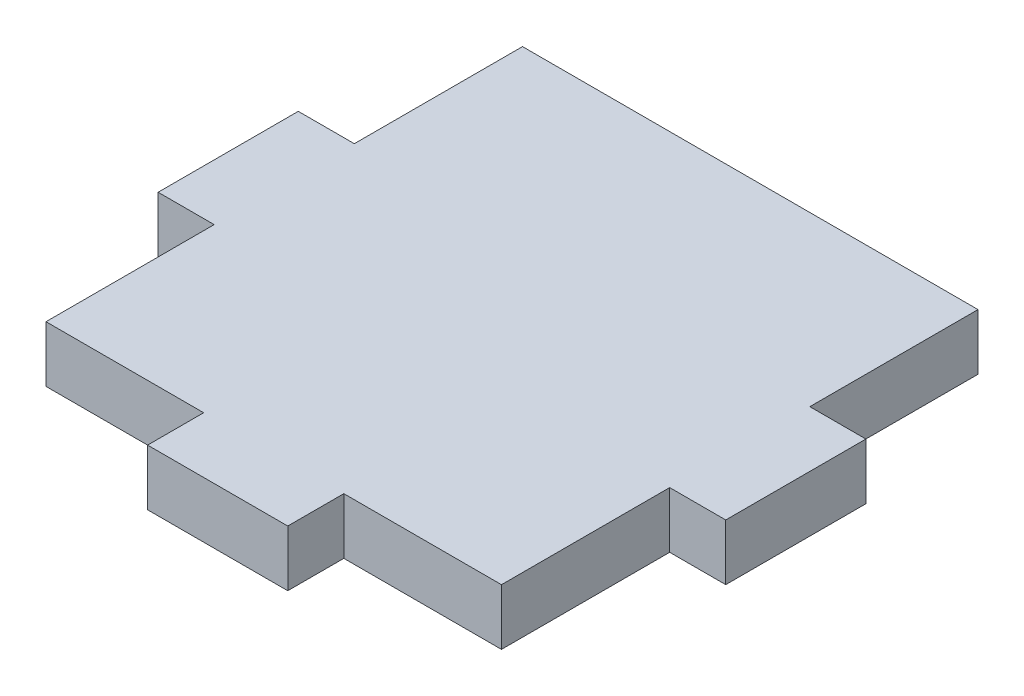
ISO-10303-21;
HEADER;
FILE_DESCRIPTION(('STEP AP214'),'2;1');
FILE_NAME('part.step','',(''),(''),'','','');
FILE_SCHEMA(('AUTOMOTIVE_DESIGN { 1 0 10303 214 1 1 1 1 }'));
ENDSEC;
DATA;
#1=APPLICATION_CONTEXT('core data for automotive mechanical design processes');
#2=APPLICATION_PROTOCOL_DEFINITION('international standard','automotive_design',2000,#1);
#3=PRODUCT_CONTEXT('',#1,'mechanical');
#4=PRODUCT('Part','Part','',(#3));
#5=PRODUCT_RELATED_PRODUCT_CATEGORY('part','',(#4));
#6=PRODUCT_DEFINITION_FORMATION('','',#4);
#7=PRODUCT_DEFINITION_CONTEXT('part definition',#1,'design');
#8=PRODUCT_DEFINITION('design','',#6,#7);
#9=PRODUCT_DEFINITION_SHAPE('','',#8);
#10=(LENGTH_UNIT() NAMED_UNIT(*) SI_UNIT(.MILLI.,.METRE.));
#11=(NAMED_UNIT(*) PLANE_ANGLE_UNIT() SI_UNIT($,.RADIAN.));
#12=(NAMED_UNIT(*) SI_UNIT($,.STERADIAN.) SOLID_ANGLE_UNIT());
#13=UNCERTAINTY_MEASURE_WITH_UNIT(LENGTH_MEASURE(1.E-05),#10,'distance_accuracy_value','');
#14=(GEOMETRIC_REPRESENTATION_CONTEXT(3) GLOBAL_UNCERTAINTY_ASSIGNED_CONTEXT((#13)) GLOBAL_UNIT_ASSIGNED_CONTEXT((#10,
#11,#12)) REPRESENTATION_CONTEXT('',''));
#15=CARTESIAN_POINT('',(0.,0.,0.));
#16=DIRECTION('',(0.,0.,1.));
#17=DIRECTION('',(1.,0.,0.));
#18=AXIS2_PLACEMENT_3D('',#15,#16,#17);
#19=CARTESIAN_POINT('',(0.,4.,0.));
#20=DIRECTION('',(1.,0.,0.));
#21=DIRECTION('',(0.,0.,-1.));
#22=AXIS2_PLACEMENT_3D('',#19,#20,#21);
#23=PLANE('',#22);
#24=DIRECTION('',(0.,-1.,0.));
#25=VECTOR('',#24,1.);
#26=CARTESIAN_POINT('',(0.,4.,12.));
#27=LINE('',#26,#25);
#28=CARTESIAN_POINT('',(0.,4.,12.));
#29=VERTEX_POINT('',#28);
#30=CARTESIAN_POINT('',(0.,0.,12.));
#31=VERTEX_POINT('',#30);
#32=EDGE_CURVE('E303',#29,#31,#27,.T.);
#33=ORIENTED_EDGE('',*,*,#32,.F.);
#34=DIRECTION('',(0.,0.,1.));
#35=VECTOR('',#34,1.);
#36=CARTESIAN_POINT('',(0.,4.,0.));
#37=LINE('',#36,#35);
#38=CARTESIAN_POINT('',(0.,4.,0.));
#39=VERTEX_POINT('',#38);
#40=EDGE_CURVE('E174',#39,#29,#37,.T.);
#41=ORIENTED_EDGE('',*,*,#40,.F.);
#42=DIRECTION('',(0.,-1.,0.));
#43=VECTOR('',#42,1.);
#44=CARTESIAN_POINT('',(0.,4.,0.));
#45=LINE('',#44,#43);
#46=CARTESIAN_POINT('',(0.,0.,0.));
#47=VERTEX_POINT('',#46);
#48=EDGE_CURVE('E256',#39,#47,#45,.T.);
#49=ORIENTED_EDGE('',*,*,#48,.T.);
#50=DIRECTION('',(0.,0.,1.));
#51=VECTOR('',#50,1.);
#52=CARTESIAN_POINT('',(0.,0.,0.));
#53=LINE('',#52,#51);
#54=EDGE_CURVE('E248',#47,#31,#53,.T.);
#55=ORIENTED_EDGE('',*,*,#54,.T.);
#56=EDGE_LOOP('',(#33,#41,#49,#55));
#57=FACE_BOUND('',#56,.T.);
#58=ADVANCED_FACE('F38',(#57),#23,.F.);
#59=CARTESIAN_POINT('',(32.5,4.,0.));
#60=DIRECTION('',(-1.,0.,0.));
#61=DIRECTION('',(0.,0.,1.));
#62=AXIS2_PLACEMENT_3D('',#59,#60,#61);
#63=PLANE('',#62);
#64=DIRECTION('',(0.,-1.,0.));
#65=VECTOR('',#64,1.);
#66=CARTESIAN_POINT('',(32.5,4.,22.));
#67=LINE('',#66,#65);
#68=CARTESIAN_POINT('',(32.5,4.,22.));
#69=VERTEX_POINT('',#68);
#70=CARTESIAN_POINT('',(32.5,0.,22.));
#71=VERTEX_POINT('',#70);
#72=EDGE_CURVE('E310',#69,#71,#67,.T.);
#73=ORIENTED_EDGE('',*,*,#72,.F.);
#74=DIRECTION('',(0.,0.,-1.));
#75=VECTOR('',#74,1.);
#76=CARTESIAN_POINT('',(32.5,4.,0.));
#77=LINE('',#76,#75);
#78=CARTESIAN_POINT('',(32.5,4.,34.));
#79=VERTEX_POINT('',#78);
#80=EDGE_CURVE('E267',#79,#69,#77,.T.);
#81=ORIENTED_EDGE('',*,*,#80,.F.);
#82=DIRECTION('',(0.,-1.,0.));
#83=VECTOR('',#82,1.);
#84=CARTESIAN_POINT('',(32.5,4.,34.));
#85=LINE('',#84,#83);
#86=CARTESIAN_POINT('',(32.5,0.,34.));
#87=VERTEX_POINT('',#86);
#88=EDGE_CURVE('E46',#79,#87,#85,.T.);
#89=ORIENTED_EDGE('',*,*,#88,.T.);
#90=DIRECTION('',(0.,0.,-1.));
#91=VECTOR('',#90,1.);
#92=CARTESIAN_POINT('',(32.5,0.,0.));
#93=LINE('',#92,#91);
#94=EDGE_CURVE('E180',#87,#71,#93,.T.);
#95=ORIENTED_EDGE('',*,*,#94,.T.);
#96=EDGE_LOOP('',(#73,#81,#89,#95));
#97=FACE_BOUND('',#96,.T.);
#98=ADVANCED_FACE('F265',(#97),#63,.F.);
#99=CARTESIAN_POINT('',(0.,4.,34.));
#100=DIRECTION('',(0.,0.,-1.));
#101=DIRECTION('',(-1.,0.,0.));
#102=AXIS2_PLACEMENT_3D('',#99,#100,#101);
#103=PLANE('',#102);
#104=DIRECTION('',(0.,-1.,0.));
#105=VECTOR('',#104,1.);
#106=CARTESIAN_POINT('',(11.25,4.,34.));
#107=LINE('',#106,#105);
#108=CARTESIAN_POINT('',(11.25,4.,34.));
#109=VERTEX_POINT('',#108);
#110=CARTESIAN_POINT('',(11.25,0.,34.));
#111=VERTEX_POINT('',#110);
#112=EDGE_CURVE('E224',#109,#111,#107,.T.);
#113=ORIENTED_EDGE('',*,*,#112,.F.);
#114=DIRECTION('',(1.,0.,0.));
#115=VECTOR('',#114,1.);
#116=CARTESIAN_POINT('',(0.,4.,34.));
#117=LINE('',#116,#115);
#118=CARTESIAN_POINT('',(0.,4.,34.));
#119=VERTEX_POINT('',#118);
#120=EDGE_CURVE('E187',#119,#109,#117,.T.);
#121=ORIENTED_EDGE('',*,*,#120,.F.);
#122=DIRECTION('',(0.,-1.,0.));
#123=VECTOR('',#122,1.);
#124=CARTESIAN_POINT('',(0.,4.,34.));
#125=LINE('',#124,#123);
#126=CARTESIAN_POINT('',(0.,0.,34.));
#127=VERTEX_POINT('',#126);
#128=EDGE_CURVE('E12',#119,#127,#125,.T.);
#129=ORIENTED_EDGE('',*,*,#128,.T.);
#130=DIRECTION('',(1.,0.,0.));
#131=VECTOR('',#130,1.);
#132=CARTESIAN_POINT('',(0.,0.,34.));
#133=LINE('',#132,#131);
#134=EDGE_CURVE('E247',#127,#111,#133,.T.);
#135=ORIENTED_EDGE('',*,*,#134,.T.);
#136=EDGE_LOOP('',(#113,#121,#129,#135));
#137=FACE_BOUND('',#136,.T.);
#138=ADVANCED_FACE('F318',(#137),#103,.F.);
#139=CARTESIAN_POINT('',(0.,4.,22.));
#140=VERTEX_POINT('',#139);
#141=EDGE_CURVE('E164',#140,#119,#37,.T.);
#142=ORIENTED_EDGE('',*,*,#141,.F.);
#143=DIRECTION('',(0.,-1.,0.));
#144=VECTOR('',#143,1.);
#145=CARTESIAN_POINT('',(0.,4.,22.));
#146=LINE('',#145,#144);
#147=CARTESIAN_POINT('',(0.,0.,22.));
#148=VERTEX_POINT('',#147);
#149=EDGE_CURVE('E149',#140,#148,#146,.T.);
#150=ORIENTED_EDGE('',*,*,#149,.T.);
#151=EDGE_CURVE('E223',#148,#127,#53,.T.);
#152=ORIENTED_EDGE('',*,*,#151,.T.);
#153=ORIENTED_EDGE('',*,*,#128,.F.);
#154=EDGE_LOOP('',(#142,#150,#152,#153));
#155=FACE_BOUND('',#154,.T.);
#156=ADVANCED_FACE('F40',(#155),#23,.F.);
#157=CARTESIAN_POINT('',(21.25,4.,34.));
#158=VERTEX_POINT('',#157);
#159=EDGE_CURVE('E179',#158,#79,#117,.T.);
#160=ORIENTED_EDGE('',*,*,#159,.F.);
#161=DIRECTION('',(0.,-1.,0.));
#162=VECTOR('',#161,1.);
#163=CARTESIAN_POINT('',(21.25,4.,34.));
#164=LINE('',#163,#162);
#165=CARTESIAN_POINT('',(21.25,0.,34.));
#166=VERTEX_POINT('',#165);
#167=EDGE_CURVE('E220',#158,#166,#164,.T.);
#168=ORIENTED_EDGE('',*,*,#167,.T.);
#169=EDGE_CURVE('E241',#166,#87,#133,.T.);
#170=ORIENTED_EDGE('',*,*,#169,.T.);
#171=ORIENTED_EDGE('',*,*,#88,.F.);
#172=EDGE_LOOP('',(#160,#168,#170,#171));
#173=FACE_BOUND('',#172,.T.);
#174=ADVANCED_FACE('F269',(#173),#103,.F.);
#175=CARTESIAN_POINT('',(32.5,4.,12.));
#176=VERTEX_POINT('',#175);
#177=CARTESIAN_POINT('',(32.5,4.,0.));
#178=VERTEX_POINT('',#177);
#179=EDGE_CURVE('E273',#176,#178,#77,.T.);
#180=ORIENTED_EDGE('',*,*,#179,.F.);
#181=DIRECTION('',(0.,-1.,0.));
#182=VECTOR('',#181,1.);
#183=CARTESIAN_POINT('',(32.5,4.,12.));
#184=LINE('',#183,#182);
#185=CARTESIAN_POINT('',(32.5,0.,12.));
#186=VERTEX_POINT('',#185);
#187=EDGE_CURVE('E308',#176,#186,#184,.T.);
#188=ORIENTED_EDGE('',*,*,#187,.T.);
#189=CARTESIAN_POINT('',(32.5,0.,0.));
#190=VERTEX_POINT('',#189);
#191=EDGE_CURVE('E251',#186,#190,#93,.T.);
#192=ORIENTED_EDGE('',*,*,#191,.T.);
#193=DIRECTION('',(0.,-1.,0.));
#194=VECTOR('',#193,1.);
#195=CARTESIAN_POINT('',(32.5,4.,0.));
#196=LINE('',#195,#194);
#197=EDGE_CURVE('E259',#178,#190,#196,.T.);
#198=ORIENTED_EDGE('',*,*,#197,.F.);
#199=EDGE_LOOP('',(#180,#188,#192,#198));
#200=FACE_BOUND('',#199,.T.);
#201=ADVANCED_FACE('F349',(#200),#63,.F.);
#202=CARTESIAN_POINT('',(0.,4.,0.));
#203=DIRECTION('',(0.,0.,1.));
#204=DIRECTION('',(1.,0.,0.));
#205=AXIS2_PLACEMENT_3D('',#202,#203,#204);
#206=PLANE('',#205);
#207=DIRECTION('',(-1.,0.,0.));
#208=VECTOR('',#207,1.);
#209=CARTESIAN_POINT('',(0.,0.,0.));
#210=LINE('',#209,#208);
#211=EDGE_CURVE('E175',#190,#47,#210,.T.);
#212=ORIENTED_EDGE('',*,*,#211,.T.);
#213=ORIENTED_EDGE('',*,*,#48,.F.);
#214=DIRECTION('',(-1.,0.,0.));
#215=VECTOR('',#214,1.);
#216=CARTESIAN_POINT('',(0.,4.,0.));
#217=LINE('',#216,#215);
#218=EDGE_CURVE('E260',#178,#39,#217,.T.);
#219=ORIENTED_EDGE('',*,*,#218,.F.);
#220=ORIENTED_EDGE('',*,*,#197,.T.);
#221=EDGE_LOOP('',(#212,#213,#219,#220));
#222=FACE_BOUND('',#221,.T.);
#223=ADVANCED_FACE('F353',(#222),#206,.F.);
#224=CARTESIAN_POINT('',(0.,4.,0.));
#225=DIRECTION('',(0.,1.,0.));
#226=DIRECTION('',(0.,0.,1.));
#227=AXIS2_PLACEMENT_3D('',#224,#225,#226);
#228=PLANE('',#227);
#229=ORIENTED_EDGE('',*,*,#40,.T.);
#230=DIRECTION('',(1.,0.,0.));
#231=VECTOR('',#230,1.);
#232=CARTESIAN_POINT('',(-4.00000000000001,4.,12.));
#233=LINE('',#232,#231);
#234=CARTESIAN_POINT('',(-4.00000000000001,4.,12.));
#235=VERTEX_POINT('',#234);
#236=EDGE_CURVE('E157',#235,#29,#233,.T.);
#237=ORIENTED_EDGE('',*,*,#236,.F.);
#238=DIRECTION('',(0.,0.,-1.));
#239=VECTOR('',#238,1.);
#240=CARTESIAN_POINT('',(-4.00000000000001,4.,22.));
#241=LINE('',#240,#239);
#242=CARTESIAN_POINT('',(-4.00000000000001,4.,22.));
#243=VERTEX_POINT('',#242);
#244=EDGE_CURVE('E168',#243,#235,#241,.T.);
#245=ORIENTED_EDGE('',*,*,#244,.F.);
#246=DIRECTION('',(-1.,0.,0.));
#247=VECTOR('',#246,1.);
#248=CARTESIAN_POINT('',(-4.00000000000001,4.,22.));
#249=LINE('',#248,#247);
#250=EDGE_CURVE('E152',#140,#243,#249,.T.);
#251=ORIENTED_EDGE('',*,*,#250,.F.);
#252=ORIENTED_EDGE('',*,*,#141,.T.);
#253=ORIENTED_EDGE('',*,*,#120,.T.);
#254=DIRECTION('',(0.,0.,-1.));
#255=VECTOR('',#254,1.);
#256=CARTESIAN_POINT('',(11.25,4.,38.));
#257=LINE('',#256,#255);
#258=CARTESIAN_POINT('',(11.25,4.,38.));
#259=VERTEX_POINT('',#258);
#260=EDGE_CURVE('E202',#259,#109,#257,.T.);
#261=ORIENTED_EDGE('',*,*,#260,.F.);
#262=DIRECTION('',(-1.,0.,0.));
#263=VECTOR('',#262,1.);
#264=CARTESIAN_POINT('',(11.25,4.,38.));
#265=LINE('',#264,#263);
#266=CARTESIAN_POINT('',(21.25,4.,38.));
#267=VERTEX_POINT('',#266);
#268=EDGE_CURVE('E206',#267,#259,#265,.T.);
#269=ORIENTED_EDGE('',*,*,#268,.F.);
#270=DIRECTION('',(0.,0.,1.));
#271=VECTOR('',#270,1.);
#272=CARTESIAN_POINT('',(21.25,4.,38.));
#273=LINE('',#272,#271);
#274=EDGE_CURVE('E219',#158,#267,#273,.T.);
#275=ORIENTED_EDGE('',*,*,#274,.F.);
#276=ORIENTED_EDGE('',*,*,#159,.T.);
#277=ORIENTED_EDGE('',*,*,#80,.T.);
#278=DIRECTION('',(-1.,0.,0.));
#279=VECTOR('',#278,1.);
#280=CARTESIAN_POINT('',(32.5,4.,22.));
#281=LINE('',#280,#279);
#282=CARTESIAN_POINT('',(36.5,4.,22.));
#283=VERTEX_POINT('',#282);
#284=EDGE_CURVE('E297',#283,#69,#281,.T.);
#285=ORIENTED_EDGE('',*,*,#284,.F.);
#286=DIRECTION('',(0.,0.,1.));
#287=VECTOR('',#286,1.);
#288=CARTESIAN_POINT('',(36.5,4.,22.));
#289=LINE('',#288,#287);
#290=CARTESIAN_POINT('',(36.5,4.,12.));
#291=VERTEX_POINT('',#290);
#292=EDGE_CURVE('E306',#291,#283,#289,.T.);
#293=ORIENTED_EDGE('',*,*,#292,.F.);
#294=DIRECTION('',(1.,0.,0.));
#295=VECTOR('',#294,1.);
#296=CARTESIAN_POINT('',(32.5,4.,12.));
#297=LINE('',#296,#295);
#298=EDGE_CURVE('E291',#176,#291,#297,.T.);
#299=ORIENTED_EDGE('',*,*,#298,.F.);
#300=ORIENTED_EDGE('',*,*,#179,.T.);
#301=ORIENTED_EDGE('',*,*,#218,.T.);
#302=EDGE_LOOP('',(#229,#237,#245,#251,#252,#253,#261,#269,#275,#276,#277,#285,#293,#299,#300,#301));
#303=FACE_BOUND('',#302,.T.);
#304=ADVANCED_FACE('F162',(#303),#228,.T.);
#305=CARTESIAN_POINT('',(0.,0.,0.));
#306=DIRECTION('',(0.,1.,0.));
#307=DIRECTION('',(0.,0.,1.));
#308=AXIS2_PLACEMENT_3D('',#305,#306,#307);
#309=PLANE('',#308);
#310=ORIENTED_EDGE('',*,*,#54,.F.);
#311=ORIENTED_EDGE('',*,*,#211,.F.);
#312=ORIENTED_EDGE('',*,*,#191,.F.);
#313=DIRECTION('',(1.,0.,0.));
#314=VECTOR('',#313,1.);
#315=CARTESIAN_POINT('',(32.5,0.,12.));
#316=LINE('',#315,#314);
#317=CARTESIAN_POINT('',(36.5,0.,12.));
#318=VERTEX_POINT('',#317);
#319=EDGE_CURVE('E61',#186,#318,#316,.T.);
#320=ORIENTED_EDGE('',*,*,#319,.T.);
#321=DIRECTION('',(0.,0.,1.));
#322=VECTOR('',#321,1.);
#323=CARTESIAN_POINT('',(36.5,0.,22.));
#324=LINE('',#323,#322);
#325=CARTESIAN_POINT('',(36.5,0.,22.));
#326=VERTEX_POINT('',#325);
#327=EDGE_CURVE('E299',#318,#326,#324,.T.);
#328=ORIENTED_EDGE('',*,*,#327,.T.);
#329=DIRECTION('',(-1.,0.,0.));
#330=VECTOR('',#329,1.);
#331=CARTESIAN_POINT('',(32.5,0.,22.));
#332=LINE('',#331,#330);
#333=EDGE_CURVE('E302',#326,#71,#332,.T.);
#334=ORIENTED_EDGE('',*,*,#333,.T.);
#335=ORIENTED_EDGE('',*,*,#94,.F.);
#336=ORIENTED_EDGE('',*,*,#169,.F.);
#337=DIRECTION('',(0.,0.,1.));
#338=VECTOR('',#337,1.);
#339=CARTESIAN_POINT('',(21.25,0.,38.));
#340=LINE('',#339,#338);
#341=CARTESIAN_POINT('',(21.25,0.,38.));
#342=VERTEX_POINT('',#341);
#343=EDGE_CURVE('E209',#166,#342,#340,.T.);
#344=ORIENTED_EDGE('',*,*,#343,.T.);
#345=DIRECTION('',(-1.,0.,0.));
#346=VECTOR('',#345,1.);
#347=CARTESIAN_POINT('',(11.25,0.,38.));
#348=LINE('',#347,#346);
#349=CARTESIAN_POINT('',(11.25,0.,38.));
#350=VERTEX_POINT('',#349);
#351=EDGE_CURVE('E212',#342,#350,#348,.T.);
#352=ORIENTED_EDGE('',*,*,#351,.T.);
#353=DIRECTION('',(0.,0.,-1.));
#354=VECTOR('',#353,1.);
#355=CARTESIAN_POINT('',(11.25,0.,38.));
#356=LINE('',#355,#354);
#357=EDGE_CURVE('E216',#350,#111,#356,.T.);
#358=ORIENTED_EDGE('',*,*,#357,.T.);
#359=ORIENTED_EDGE('',*,*,#134,.F.);
#360=ORIENTED_EDGE('',*,*,#151,.F.);
#361=DIRECTION('',(-1.,0.,0.));
#362=VECTOR('',#361,1.);
#363=CARTESIAN_POINT('',(-4.00000000000001,0.,22.));
#364=LINE('',#363,#362);
#365=CARTESIAN_POINT('',(-4.00000000000001,0.,22.));
#366=VERTEX_POINT('',#365);
#367=EDGE_CURVE('E53',#148,#366,#364,.T.);
#368=ORIENTED_EDGE('',*,*,#367,.T.);
#369=DIRECTION('',(0.,0.,-1.));
#370=VECTOR('',#369,1.);
#371=CARTESIAN_POINT('',(-4.00000000000001,0.,22.));
#372=LINE('',#371,#370);
#373=CARTESIAN_POINT('',(-4.00000000000001,0.,12.));
#374=VERTEX_POINT('',#373);
#375=EDGE_CURVE('E323',#366,#374,#372,.T.);
#376=ORIENTED_EDGE('',*,*,#375,.T.);
#377=DIRECTION('',(1.,0.,0.));
#378=VECTOR('',#377,1.);
#379=CARTESIAN_POINT('',(-4.00000000000001,0.,12.));
#380=LINE('',#379,#378);
#381=EDGE_CURVE('E170',#374,#31,#380,.T.);
#382=ORIENTED_EDGE('',*,*,#381,.T.);
#383=EDGE_LOOP('',(#310,#311,#312,#320,#328,#334,#335,#336,#344,#352,#358,#359,#360,#368,#376,#382));
#384=FACE_BOUND('',#383,.T.);
#385=ADVANCED_FACE('F239',(#384),#309,.F.);
#386=CARTESIAN_POINT('',(21.25,4.,38.));
#387=DIRECTION('',(1.,0.,0.));
#388=DIRECTION('',(0.,0.,-1.));
#389=AXIS2_PLACEMENT_3D('',#386,#387,#388);
#390=PLANE('',#389);
#391=ORIENTED_EDGE('',*,*,#343,.F.);
#392=ORIENTED_EDGE('',*,*,#167,.F.);
#393=ORIENTED_EDGE('',*,*,#274,.T.);
#394=DIRECTION('',(0.,-1.,0.));
#395=VECTOR('',#394,1.);
#396=CARTESIAN_POINT('',(21.25,4.,38.));
#397=LINE('',#396,#395);
#398=EDGE_CURVE('E185',#267,#342,#397,.T.);
#399=ORIENTED_EDGE('',*,*,#398,.T.);
#400=EDGE_LOOP('',(#391,#392,#393,#399));
#401=FACE_BOUND('',#400,.T.);
#402=ADVANCED_FACE('F232',(#401),#390,.T.);
#403=CARTESIAN_POINT('',(11.25,4.,38.));
#404=DIRECTION('',(-1.,0.,0.));
#405=DIRECTION('',(0.,0.,1.));
#406=AXIS2_PLACEMENT_3D('',#403,#404,#405);
#407=PLANE('',#406);
#408=ORIENTED_EDGE('',*,*,#357,.F.);
#409=DIRECTION('',(0.,-1.,0.));
#410=VECTOR('',#409,1.);
#411=CARTESIAN_POINT('',(11.25,4.,38.));
#412=LINE('',#411,#410);
#413=EDGE_CURVE('E225',#259,#350,#412,.T.);
#414=ORIENTED_EDGE('',*,*,#413,.F.);
#415=ORIENTED_EDGE('',*,*,#260,.T.);
#416=ORIENTED_EDGE('',*,*,#112,.T.);
#417=EDGE_LOOP('',(#408,#414,#415,#416));
#418=FACE_BOUND('',#417,.T.);
#419=ADVANCED_FACE('F316',(#418),#407,.T.);
#420=CARTESIAN_POINT('',(11.25,4.,38.));
#421=DIRECTION('',(0.,0.,1.));
#422=DIRECTION('',(1.,0.,0.));
#423=AXIS2_PLACEMENT_3D('',#420,#421,#422);
#424=PLANE('',#423);
#425=ORIENTED_EDGE('',*,*,#351,.F.);
#426=ORIENTED_EDGE('',*,*,#398,.F.);
#427=ORIENTED_EDGE('',*,*,#268,.T.);
#428=ORIENTED_EDGE('',*,*,#413,.T.);
#429=EDGE_LOOP('',(#425,#426,#427,#428));
#430=FACE_BOUND('',#429,.T.);
#431=ADVANCED_FACE('F235',(#430),#424,.T.);
#432=CARTESIAN_POINT('',(36.5,4.,22.));
#433=DIRECTION('',(1.,0.,0.));
#434=DIRECTION('',(0.,0.,-1.));
#435=AXIS2_PLACEMENT_3D('',#432,#433,#434);
#436=PLANE('',#435);
#437=ORIENTED_EDGE('',*,*,#327,.F.);
#438=DIRECTION('',(0.,-1.,0.));
#439=VECTOR('',#438,1.);
#440=CARTESIAN_POINT('',(36.5,4.,12.));
#441=LINE('',#440,#439);
#442=EDGE_CURVE('E213',#291,#318,#441,.T.);
#443=ORIENTED_EDGE('',*,*,#442,.F.);
#444=ORIENTED_EDGE('',*,*,#292,.T.);
#445=DIRECTION('',(0.,-1.,0.));
#446=VECTOR('',#445,1.);
#447=CARTESIAN_POINT('',(36.5,4.,22.));
#448=LINE('',#447,#446);
#449=EDGE_CURVE('E296',#283,#326,#448,.T.);
#450=ORIENTED_EDGE('',*,*,#449,.T.);
#451=EDGE_LOOP('',(#437,#443,#444,#450));
#452=FACE_BOUND('',#451,.T.);
#453=ADVANCED_FACE('F399',(#452),#436,.T.);
#454=CARTESIAN_POINT('',(32.5,4.,12.));
#455=DIRECTION('',(0.,0.,-1.));
#456=DIRECTION('',(-1.,0.,0.));
#457=AXIS2_PLACEMENT_3D('',#454,#455,#456);
#458=PLANE('',#457);
#459=ORIENTED_EDGE('',*,*,#319,.F.);
#460=ORIENTED_EDGE('',*,*,#187,.F.);
#461=ORIENTED_EDGE('',*,*,#298,.T.);
#462=ORIENTED_EDGE('',*,*,#442,.T.);
#463=EDGE_LOOP('',(#459,#460,#461,#462));
#464=FACE_BOUND('',#463,.T.);
#465=ADVANCED_FACE('F345',(#464),#458,.T.);
#466=CARTESIAN_POINT('',(32.5,4.,22.));
#467=DIRECTION('',(0.,0.,1.));
#468=DIRECTION('',(1.,0.,0.));
#469=AXIS2_PLACEMENT_3D('',#466,#467,#468);
#470=PLANE('',#469);
#471=ORIENTED_EDGE('',*,*,#333,.F.);
#472=ORIENTED_EDGE('',*,*,#449,.F.);
#473=ORIENTED_EDGE('',*,*,#284,.T.);
#474=ORIENTED_EDGE('',*,*,#72,.T.);
#475=EDGE_LOOP('',(#471,#472,#473,#474));
#476=FACE_BOUND('',#475,.T.);
#477=ADVANCED_FACE('F344',(#476),#470,.T.);
#478=CARTESIAN_POINT('',(-4.00000000000001,4.,12.));
#479=DIRECTION('',(0.,0.,-1.));
#480=DIRECTION('',(-1.,0.,0.));
#481=AXIS2_PLACEMENT_3D('',#478,#479,#480);
#482=PLANE('',#481);
#483=ORIENTED_EDGE('',*,*,#381,.F.);
#484=DIRECTION('',(0.,-1.,0.));
#485=VECTOR('',#484,1.);
#486=CARTESIAN_POINT('',(-4.00000000000001,4.,12.));
#487=LINE('',#486,#485);
#488=EDGE_CURVE('E333',#235,#374,#487,.T.);
#489=ORIENTED_EDGE('',*,*,#488,.F.);
#490=ORIENTED_EDGE('',*,*,#236,.T.);
#491=ORIENTED_EDGE('',*,*,#32,.T.);
#492=EDGE_LOOP('',(#483,#489,#490,#491));
#493=FACE_BOUND('',#492,.T.);
#494=ADVANCED_FACE('F365',(#493),#482,.T.);
#495=CARTESIAN_POINT('',(-4.00000000000001,4.,22.));
#496=DIRECTION('',(-1.,0.,0.));
#497=DIRECTION('',(0.,0.,1.));
#498=AXIS2_PLACEMENT_3D('',#495,#496,#497);
#499=PLANE('',#498);
#500=ORIENTED_EDGE('',*,*,#375,.F.);
#501=DIRECTION('',(0.,-1.,0.));
#502=VECTOR('',#501,1.);
#503=CARTESIAN_POINT('',(-4.00000000000001,4.,22.));
#504=LINE('',#503,#502);
#505=EDGE_CURVE('E156',#243,#366,#504,.T.);
#506=ORIENTED_EDGE('',*,*,#505,.F.);
#507=ORIENTED_EDGE('',*,*,#244,.T.);
#508=ORIENTED_EDGE('',*,*,#488,.T.);
#509=EDGE_LOOP('',(#500,#506,#507,#508));
#510=FACE_BOUND('',#509,.T.);
#511=ADVANCED_FACE('F364',(#510),#499,.T.);
#512=CARTESIAN_POINT('',(-4.00000000000001,4.,22.));
#513=DIRECTION('',(0.,0.,1.));
#514=DIRECTION('',(1.,0.,0.));
#515=AXIS2_PLACEMENT_3D('',#512,#513,#514);
#516=PLANE('',#515);
#517=ORIENTED_EDGE('',*,*,#367,.F.);
#518=ORIENTED_EDGE('',*,*,#149,.F.);
#519=ORIENTED_EDGE('',*,*,#250,.T.);
#520=ORIENTED_EDGE('',*,*,#505,.T.);
#521=EDGE_LOOP('',(#517,#518,#519,#520));
#522=FACE_BOUND('',#521,.T.);
#523=ADVANCED_FACE('F151',(#522),#516,.T.);
#524=CLOSED_SHELL('',(#58,#98,#138,#156,#174,#201,#223,#304,#385,#402,#419,#431,#453,#465,#477,
#494,#511,#523));
#525=MANIFOLD_SOLID_BREP('B2',#524);
#526=ADVANCED_BREP_SHAPE_REPRESENTATION('',(#18,#525),#14);
#527=SHAPE_DEFINITION_REPRESENTATION(#9,#526);
ENDSEC;
END-ISO-10303-21;
